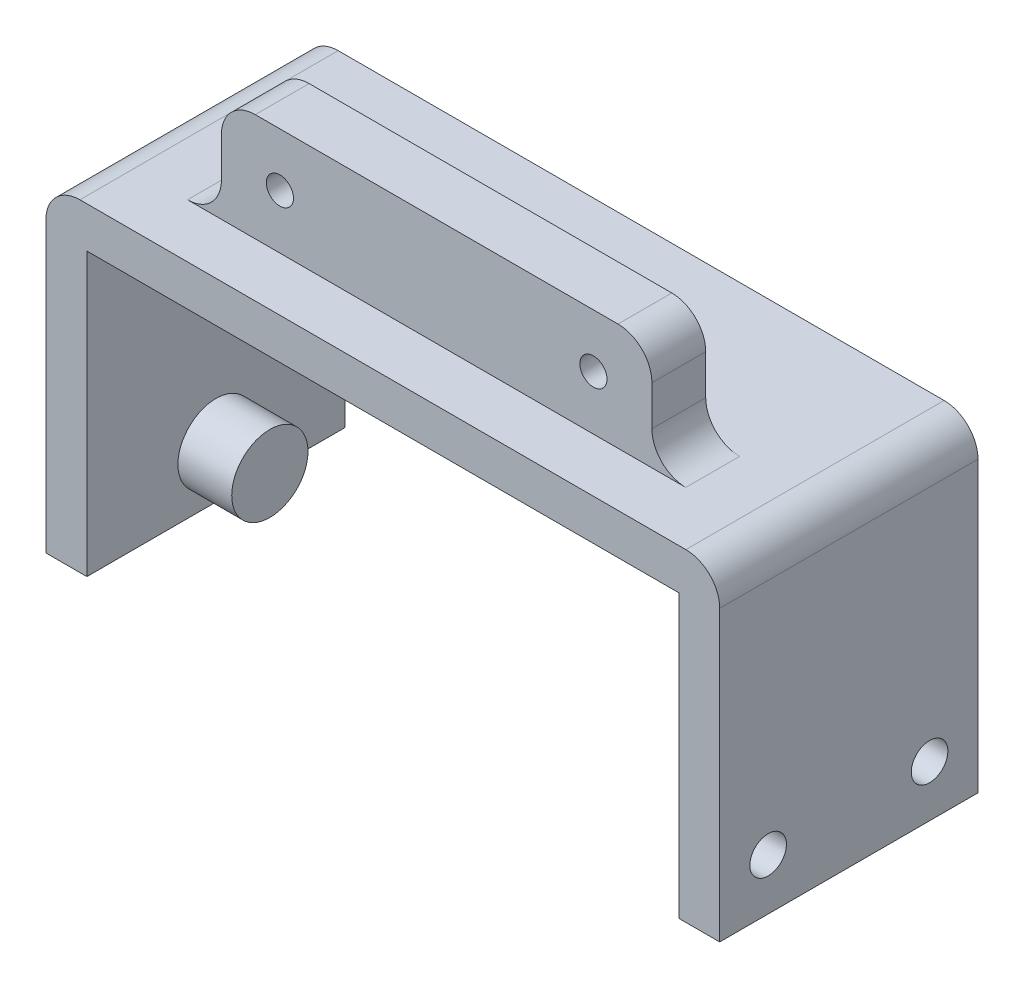
ISO-10303-21;
HEADER;
FILE_DESCRIPTION(('STEP AP214'),'2;1');
FILE_NAME('part.step','',(''),(''),'','','');
FILE_SCHEMA(('AUTOMOTIVE_DESIGN { 1 0 10303 214 1 1 1 1 }'));
ENDSEC;
DATA;
#1=APPLICATION_CONTEXT('core data for automotive mechanical design processes');
#2=APPLICATION_PROTOCOL_DEFINITION('international standard','automotive_design',2000,#1);
#3=PRODUCT_CONTEXT('',#1,'mechanical');
#4=PRODUCT('Part','Part','',(#3));
#5=PRODUCT_RELATED_PRODUCT_CATEGORY('part','',(#4));
#6=PRODUCT_DEFINITION_FORMATION('','',#4);
#7=PRODUCT_DEFINITION_CONTEXT('part definition',#1,'design');
#8=PRODUCT_DEFINITION('design','',#6,#7);
#9=PRODUCT_DEFINITION_SHAPE('','',#8);
#10=(LENGTH_UNIT() NAMED_UNIT(*) SI_UNIT(.MILLI.,.METRE.));
#11=(NAMED_UNIT(*) PLANE_ANGLE_UNIT() SI_UNIT($,.RADIAN.));
#12=(NAMED_UNIT(*) SI_UNIT($,.STERADIAN.) SOLID_ANGLE_UNIT());
#13=UNCERTAINTY_MEASURE_WITH_UNIT(LENGTH_MEASURE(1.E-05),#10,'distance_accuracy_value','');
#14=(GEOMETRIC_REPRESENTATION_CONTEXT(3) GLOBAL_UNCERTAINTY_ASSIGNED_CONTEXT((#13)) GLOBAL_UNIT_ASSIGNED_CONTEXT((#10,
#11,#12)) REPRESENTATION_CONTEXT('',''));
#15=CARTESIAN_POINT('',(0.,0.,0.));
#16=DIRECTION('',(0.,0.,1.));
#17=DIRECTION('',(1.,0.,0.));
#18=AXIS2_PLACEMENT_3D('',#15,#16,#17);
#19=CARTESIAN_POINT('',(4.826,38.1,0.));
#20=DIRECTION('',(0.,-1.,0.));
#21=DIRECTION('',(0.,0.,-1.));
#22=AXIS2_PLACEMENT_3D('',#19,#20,#21);
#23=PLANE('',#22);
#24=DIRECTION('',(-1.,0.,0.));
#25=VECTOR('',#24,1.);
#26=CARTESIAN_POINT('',(4.826,38.1,-30.48));
#27=LINE('',#26,#25);
#28=CARTESIAN_POINT('',(0.826,38.1,-30.48));
#29=VERTEX_POINT('',#28);
#30=CARTESIAN_POINT('',(-70.676,38.1,-30.48));
#31=VERTEX_POINT('',#30);
#32=EDGE_CURVE('E239',#29,#31,#27,.T.);
#33=ORIENTED_EDGE('',*,*,#32,.T.);
#34=DIRECTION('',(0.,0.,-1.));
#35=VECTOR('',#34,1.);
#36=CARTESIAN_POINT('',(-70.676,38.1,0.));
#37=LINE('',#36,#35);
#38=CARTESIAN_POINT('',(-70.676,38.1,0.));
#39=VERTEX_POINT('',#38);
#40=EDGE_CURVE('E269',#31,#39,#37,.F.);
#41=ORIENTED_EDGE('',*,*,#40,.T.);
#42=DIRECTION('',(-1.,0.,0.));
#43=VECTOR('',#42,1.);
#44=CARTESIAN_POINT('',(4.826,38.1,0.));
#45=LINE('',#44,#43);
#46=CARTESIAN_POINT('',(0.826,38.1,0.));
#47=VERTEX_POINT('',#46);
#48=EDGE_CURVE('E231',#47,#39,#45,.T.);
#49=ORIENTED_EDGE('',*,*,#48,.F.);
#50=DIRECTION('',(0.,0.,1.));
#51=VECTOR('',#50,1.);
#52=CARTESIAN_POINT('',(0.826,38.1,0.));
#53=LINE('',#52,#51);
#54=EDGE_CURVE('E267',#47,#29,#53,.F.);
#55=ORIENTED_EDGE('',*,*,#54,.T.);
#56=EDGE_LOOP('',(#33,#41,#49,#55));
#57=FACE_BOUND('',#56,.T.);
#58=DIRECTION('',(1.,0.,0.));
#59=VECTOR('',#58,1.);
#60=CARTESIAN_POINT('',(-60.325,38.1,-6.34999999999999));
#61=LINE('',#60,#59);
#62=CARTESIAN_POINT('',(-64.325,38.1,-6.34999999999999));
#63=VERTEX_POINT('',#62);
#64=CARTESIAN_POINT('',(-5.525,38.1,-6.34999999999999));
#65=VERTEX_POINT('',#64);
#66=EDGE_CURVE('E306',#63,#65,#61,.T.);
#67=ORIENTED_EDGE('',*,*,#66,.F.);
#68=DIRECTION('',(0.,0.,1.));
#69=VECTOR('',#68,1.);
#70=CARTESIAN_POINT('',(-64.325,38.1,-12.7));
#71=LINE('',#70,#69);
#72=CARTESIAN_POINT('',(-64.325,38.1,-12.7));
#73=VERTEX_POINT('',#72);
#74=EDGE_CURVE('E274',#63,#73,#71,.F.);
#75=ORIENTED_EDGE('',*,*,#74,.T.);
#76=DIRECTION('',(-1.,0.,0.));
#77=VECTOR('',#76,1.);
#78=CARTESIAN_POINT('',(-60.325,38.1,-12.7));
#79=LINE('',#78,#77);
#80=CARTESIAN_POINT('',(-5.525,38.1,-12.7));
#81=VERTEX_POINT('',#80);
#82=EDGE_CURVE('E320',#81,#73,#79,.T.);
#83=ORIENTED_EDGE('',*,*,#82,.F.);
#84=DIRECTION('',(0.,0.,-1.));
#85=VECTOR('',#84,1.);
#86=CARTESIAN_POINT('',(-5.525,38.1,-6.34999999999999));
#87=LINE('',#86,#85);
#88=EDGE_CURVE('E271',#81,#65,#87,.F.);
#89=ORIENTED_EDGE('',*,*,#88,.T.);
#90=EDGE_LOOP('',(#67,#75,#83,#89));
#91=FACE_BOUND('',#90,.T.);
#92=ADVANCED_FACE('F38',(#57,#91),#23,.F.);
#93=CARTESIAN_POINT('',(-74.676,33.274,-30.48));
#94=DIRECTION('',(0.,1.,0.));
#95=DIRECTION('',(0.,0.,1.));
#96=AXIS2_PLACEMENT_3D('',#93,#94,#95);
#97=PLANE('',#96);
#98=DIRECTION('',(0.,0.,1.));
#99=VECTOR('',#98,1.);
#100=CARTESIAN_POINT('',(-69.85,33.274,0.));
#101=LINE('',#100,#99);
#102=CARTESIAN_POINT('',(-69.85,33.274,-30.48));
#103=VERTEX_POINT('',#102);
#104=CARTESIAN_POINT('',(-69.85,33.274,0.));
#105=VERTEX_POINT('',#104);
#106=EDGE_CURVE('E191',#103,#105,#101,.T.);
#107=ORIENTED_EDGE('',*,*,#106,.F.);
#108=DIRECTION('',(1.,0.,0.));
#109=VECTOR('',#108,1.);
#110=CARTESIAN_POINT('',(-74.676,33.274,-30.48));
#111=LINE('',#110,#109);
#112=CARTESIAN_POINT('',(0.,33.274,-30.48));
#113=VERTEX_POINT('',#112);
#114=EDGE_CURVE('E209',#103,#113,#111,.T.);
#115=ORIENTED_EDGE('',*,*,#114,.T.);
#116=DIRECTION('',(0.,0.,1.));
#117=VECTOR('',#116,1.);
#118=CARTESIAN_POINT('',(0.,33.274,-30.48));
#119=LINE('',#118,#117);
#120=CARTESIAN_POINT('',(0.,33.274,0.));
#121=VERTEX_POINT('',#120);
#122=EDGE_CURVE('E176',#113,#121,#119,.T.);
#123=ORIENTED_EDGE('',*,*,#122,.T.);
#124=DIRECTION('',(1.,0.,0.));
#125=VECTOR('',#124,1.);
#126=CARTESIAN_POINT('',(-74.676,33.274,0.));
#127=LINE('',#126,#125);
#128=EDGE_CURVE('E205',#105,#121,#127,.T.);
#129=ORIENTED_EDGE('',*,*,#128,.F.);
#130=EDGE_LOOP('',(#107,#115,#123,#129));
#131=FACE_BOUND('',#130,.T.);
#132=ADVANCED_FACE('F370',(#131),#97,.F.);
#133=CARTESIAN_POINT('',(4.826,0.,0.));
#134=DIRECTION('',(-1.,0.,0.));
#135=DIRECTION('',(0.,0.,1.));
#136=AXIS2_PLACEMENT_3D('',#133,#134,#135);
#137=PLANE('',#136);
#138=DIRECTION('',(0.,1.,0.));
#139=VECTOR('',#138,1.);
#140=CARTESIAN_POINT('',(4.826,0.,-30.48));
#141=LINE('',#140,#139);
#142=CARTESIAN_POINT('',(4.826,0.,-30.48));
#143=VERTEX_POINT('',#142);
#144=CARTESIAN_POINT('',(4.826,34.1,-30.48));
#145=VERTEX_POINT('',#144);
#146=EDGE_CURVE('E229',#143,#145,#141,.T.);
#147=ORIENTED_EDGE('',*,*,#146,.T.);
#148=DIRECTION('',(0.,0.,1.));
#149=VECTOR('',#148,1.);
#150=CARTESIAN_POINT('',(4.826,34.1,0.));
#151=LINE('',#150,#149);
#152=CARTESIAN_POINT('',(4.826,34.1,0.));
#153=VERTEX_POINT('',#152);
#154=EDGE_CURVE('E289',#145,#153,#151,.T.);
#155=ORIENTED_EDGE('',*,*,#154,.T.);
#156=DIRECTION('',(0.,-1.,0.));
#157=VECTOR('',#156,1.);
#158=CARTESIAN_POINT('',(4.826,0.,0.));
#159=LINE('',#158,#157);
#160=CARTESIAN_POINT('',(4.826,0.,0.));
#161=VERTEX_POINT('',#160);
#162=EDGE_CURVE('E224',#153,#161,#159,.T.);
#163=ORIENTED_EDGE('',*,*,#162,.T.);
#164=DIRECTION('',(0.,0.,-1.));
#165=VECTOR('',#164,1.);
#166=CARTESIAN_POINT('',(4.826,0.,0.));
#167=LINE('',#166,#165);
#168=EDGE_CURVE('E226',#161,#143,#167,.T.);
#169=ORIENTED_EDGE('',*,*,#168,.T.);
#170=EDGE_LOOP('',(#147,#155,#163,#169));
#171=FACE_BOUND('',#170,.T.);
#172=CARTESIAN_POINT('',(4.826,6.05,-5.71499999999998));
#173=DIRECTION('',(1.,0.,0.));
#174=DIRECTION('',(0.,0.,-1.));
#175=AXIS2_PLACEMENT_3D('',#172,#173,#174);
#176=CIRCLE('',#175,2.159);
#177=CARTESIAN_POINT('',(4.826,6.05,-7.87399999999998));
#178=VERTEX_POINT('',#177);
#179=EDGE_CURVE('E218',#178,#178,#176,.T.);
#180=ORIENTED_EDGE('',*,*,#179,.F.);
#181=EDGE_LOOP('',(#180));
#182=FACE_BOUND('',#181,.T.);
#183=CARTESIAN_POINT('',(4.826,6.05,-24.765));
#184=DIRECTION('',(1.,0.,0.));
#185=DIRECTION('',(0.,0.,1.));
#186=AXIS2_PLACEMENT_3D('',#183,#184,#185);
#187=CIRCLE('',#186,2.159);
#188=CARTESIAN_POINT('',(4.826,6.05,-22.606));
#189=VERTEX_POINT('',#188);
#190=EDGE_CURVE('E212',#189,#189,#187,.T.);
#191=ORIENTED_EDGE('',*,*,#190,.F.);
#192=EDGE_LOOP('',(#191));
#193=FACE_BOUND('',#192,.T.);
#194=ADVANCED_FACE('F385',(#171,#182,#193),#137,.F.);
#195=CARTESIAN_POINT('',(0.,0.,0.));
#196=DIRECTION('',(-1.,0.,0.));
#197=DIRECTION('',(0.,0.,1.));
#198=AXIS2_PLACEMENT_3D('',#195,#196,#197);
#199=PLANE('',#198);
#200=ORIENTED_EDGE('',*,*,#122,.F.);
#201=DIRECTION('',(0.,1.,0.));
#202=VECTOR('',#201,1.);
#203=CARTESIAN_POINT('',(0.,0.,-30.48));
#204=LINE('',#203,#202);
#205=CARTESIAN_POINT('',(0.,0.,-30.48));
#206=VERTEX_POINT('',#205);
#207=EDGE_CURVE('E227',#206,#113,#204,.T.);
#208=ORIENTED_EDGE('',*,*,#207,.F.);
#209=DIRECTION('',(0.,0.,-1.));
#210=VECTOR('',#209,1.);
#211=CARTESIAN_POINT('',(0.,0.,0.));
#212=LINE('',#211,#210);
#213=CARTESIAN_POINT('',(0.,0.,0.));
#214=VERTEX_POINT('',#213);
#215=EDGE_CURVE('E233',#214,#206,#212,.T.);
#216=ORIENTED_EDGE('',*,*,#215,.F.);
#217=DIRECTION('',(0.,-1.,0.));
#218=VECTOR('',#217,1.);
#219=CARTESIAN_POINT('',(0.,0.,0.));
#220=LINE('',#219,#218);
#221=EDGE_CURVE('E221',#121,#214,#220,.T.);
#222=ORIENTED_EDGE('',*,*,#221,.F.);
#223=EDGE_LOOP('',(#200,#208,#216,#222));
#224=FACE_BOUND('',#223,.T.);
#225=CARTESIAN_POINT('',(0.,6.05,-5.71499999999998));
#226=DIRECTION('',(1.,0.,0.));
#227=DIRECTION('',(0.,0.,-1.));
#228=AXIS2_PLACEMENT_3D('',#225,#226,#227);
#229=CIRCLE('',#228,2.159);
#230=CARTESIAN_POINT('',(0.,6.05,-7.87399999999998));
#231=VERTEX_POINT('',#230);
#232=EDGE_CURVE('E215',#231,#231,#229,.T.);
#233=ORIENTED_EDGE('',*,*,#232,.T.);
#234=EDGE_LOOP('',(#233));
#235=FACE_BOUND('',#234,.T.);
#236=CARTESIAN_POINT('',(0.,6.05,-24.765));
#237=DIRECTION('',(1.,0.,0.));
#238=DIRECTION('',(0.,0.,1.));
#239=AXIS2_PLACEMENT_3D('',#236,#237,#238);
#240=CIRCLE('',#239,2.159);
#241=CARTESIAN_POINT('',(0.,6.05,-22.606));
#242=VERTEX_POINT('',#241);
#243=EDGE_CURVE('E211',#242,#242,#240,.T.);
#244=ORIENTED_EDGE('',*,*,#243,.T.);
#245=EDGE_LOOP('',(#244));
#246=FACE_BOUND('',#245,.T.);
#247=ADVANCED_FACE('F374',(#224,#235,#246),#199,.T.);
#248=CARTESIAN_POINT('',(4.826,0.,0.));
#249=DIRECTION('',(0.,0.,-1.));
#250=DIRECTION('',(0.,1.,0.));
#251=AXIS2_PLACEMENT_3D('',#248,#249,#250);
#252=PLANE('',#251);
#253=ORIENTED_EDGE('',*,*,#48,.T.);
#254=CARTESIAN_POINT('',(-70.676,34.1,0.));
#255=DIRECTION('',(0.,0.,-1.));
#256=DIRECTION('',(0.,1.,0.));
#257=AXIS2_PLACEMENT_3D('',#254,#255,#256);
#258=CIRCLE('',#257,4.);
#259=CARTESIAN_POINT('',(-74.676,34.1,0.));
#260=VERTEX_POINT('',#259);
#261=EDGE_CURVE('E287',#39,#260,#258,.F.);
#262=ORIENTED_EDGE('',*,*,#261,.T.);
#263=DIRECTION('',(0.,1.,0.));
#264=VECTOR('',#263,1.);
#265=CARTESIAN_POINT('',(-74.676,38.1,0.));
#266=LINE('',#265,#264);
#267=CARTESIAN_POINT('',(-74.676,0.,0.));
#268=VERTEX_POINT('',#267);
#269=EDGE_CURVE('E175',#268,#260,#266,.T.);
#270=ORIENTED_EDGE('',*,*,#269,.F.);
#271=DIRECTION('',(-1.,0.,0.));
#272=VECTOR('',#271,1.);
#273=CARTESIAN_POINT('',(-74.676,0.,0.));
#274=LINE('',#273,#272);
#275=CARTESIAN_POINT('',(-69.85,0.,0.));
#276=VERTEX_POINT('',#275);
#277=EDGE_CURVE('E190',#276,#268,#274,.T.);
#278=ORIENTED_EDGE('',*,*,#277,.F.);
#279=DIRECTION('',(0.,1.,0.));
#280=VECTOR('',#279,1.);
#281=CARTESIAN_POINT('',(-69.85,0.,0.));
#282=LINE('',#281,#280);
#283=EDGE_CURVE('E199',#276,#105,#282,.T.);
#284=ORIENTED_EDGE('',*,*,#283,.T.);
#285=ORIENTED_EDGE('',*,*,#128,.T.);
#286=ORIENTED_EDGE('',*,*,#221,.T.);
#287=DIRECTION('',(-1.,0.,0.));
#288=VECTOR('',#287,1.);
#289=CARTESIAN_POINT('',(4.826,0.,0.));
#290=LINE('',#289,#288);
#291=EDGE_CURVE('E245',#161,#214,#290,.T.);
#292=ORIENTED_EDGE('',*,*,#291,.F.);
#293=ORIENTED_EDGE('',*,*,#162,.F.);
#294=CARTESIAN_POINT('',(0.826,34.1,0.));
#295=DIRECTION('',(0.,0.,-1.));
#296=DIRECTION('',(0.,1.,0.));
#297=AXIS2_PLACEMENT_3D('',#294,#295,#296);
#298=CIRCLE('',#297,4.);
#299=EDGE_CURVE('E53',#153,#47,#298,.F.);
#300=ORIENTED_EDGE('',*,*,#299,.T.);
#301=EDGE_LOOP('',(#253,#262,#270,#278,#284,#285,#286,#292,#293,#300));
#302=FACE_BOUND('',#301,.T.);
#303=ADVANCED_FACE('F368',(#302),#252,.F.);
#304=CARTESIAN_POINT('',(4.826,0.,0.));
#305=DIRECTION('',(0.,1.,0.));
#306=DIRECTION('',(0.,0.,1.));
#307=AXIS2_PLACEMENT_3D('',#304,#305,#306);
#308=PLANE('',#307);
#309=ORIENTED_EDGE('',*,*,#215,.T.);
#310=DIRECTION('',(-1.,0.,0.));
#311=VECTOR('',#310,1.);
#312=CARTESIAN_POINT('',(4.826,0.,-30.48));
#313=LINE('',#312,#311);
#314=EDGE_CURVE('E242',#143,#206,#313,.T.);
#315=ORIENTED_EDGE('',*,*,#314,.F.);
#316=ORIENTED_EDGE('',*,*,#168,.F.);
#317=ORIENTED_EDGE('',*,*,#291,.T.);
#318=EDGE_LOOP('',(#309,#315,#316,#317));
#319=FACE_BOUND('',#318,.T.);
#320=ADVANCED_FACE('F380',(#319),#308,.F.);
#321=CARTESIAN_POINT('',(4.826,0.,-30.48));
#322=DIRECTION('',(0.,0.,1.));
#323=DIRECTION('',(0.,-1.,0.));
#324=AXIS2_PLACEMENT_3D('',#321,#322,#323);
#325=PLANE('',#324);
#326=DIRECTION('',(0.,-1.,0.));
#327=VECTOR('',#326,1.);
#328=CARTESIAN_POINT('',(-74.676,38.1,-30.48));
#329=LINE('',#328,#327);
#330=CARTESIAN_POINT('',(-74.676,34.1,-30.48));
#331=VERTEX_POINT('',#330);
#332=CARTESIAN_POINT('',(-74.676,0.,-30.48));
#333=VERTEX_POINT('',#332);
#334=EDGE_CURVE('E167',#331,#333,#329,.T.);
#335=ORIENTED_EDGE('',*,*,#334,.F.);
#336=CARTESIAN_POINT('',(-70.676,34.1,-30.48));
#337=DIRECTION('',(0.,0.,1.));
#338=DIRECTION('',(0.,-1.,0.));
#339=AXIS2_PLACEMENT_3D('',#336,#337,#338);
#340=CIRCLE('',#339,4.);
#341=EDGE_CURVE('E284',#331,#31,#340,.F.);
#342=ORIENTED_EDGE('',*,*,#341,.T.);
#343=ORIENTED_EDGE('',*,*,#32,.F.);
#344=CARTESIAN_POINT('',(0.826,34.1,-30.48));
#345=DIRECTION('',(0.,0.,1.));
#346=DIRECTION('',(0.,-1.,0.));
#347=AXIS2_PLACEMENT_3D('',#344,#345,#346);
#348=CIRCLE('',#347,4.);
#349=EDGE_CURVE('E61',#29,#145,#348,.F.);
#350=ORIENTED_EDGE('',*,*,#349,.T.);
#351=ORIENTED_EDGE('',*,*,#146,.F.);
#352=ORIENTED_EDGE('',*,*,#314,.T.);
#353=ORIENTED_EDGE('',*,*,#207,.T.);
#354=ORIENTED_EDGE('',*,*,#114,.F.);
#355=DIRECTION('',(0.,1.,0.));
#356=VECTOR('',#355,1.);
#357=CARTESIAN_POINT('',(-69.85,0.,-30.48));
#358=LINE('',#357,#356);
#359=CARTESIAN_POINT('',(-69.85,0.,-30.48));
#360=VERTEX_POINT('',#359);
#361=EDGE_CURVE('E182',#360,#103,#358,.T.);
#362=ORIENTED_EDGE('',*,*,#361,.F.);
#363=DIRECTION('',(1.,0.,0.));
#364=VECTOR('',#363,1.);
#365=CARTESIAN_POINT('',(-74.676,0.,-30.48));
#366=LINE('',#365,#364);
#367=EDGE_CURVE('E179',#333,#360,#366,.T.);
#368=ORIENTED_EDGE('',*,*,#367,.F.);
#369=EDGE_LOOP('',(#335,#342,#343,#350,#351,#352,#353,#354,#362,#368));
#370=FACE_BOUND('',#369,.T.);
#371=ADVANCED_FACE('F180',(#370),#325,.F.);
#372=CARTESIAN_POINT('',(4.826,6.05,-5.71499999999998));
#373=DIRECTION('',(-1.,0.,0.));
#374=DIRECTION('',(0.,0.,1.));
#375=AXIS2_PLACEMENT_3D('',#372,#373,#374);
#376=CYLINDRICAL_SURFACE('',#375,2.159);
#377=ORIENTED_EDGE('',*,*,#179,.T.);
#378=EDGE_LOOP('',(#377));
#379=FACE_BOUND('',#378,.T.);
#380=ORIENTED_EDGE('',*,*,#232,.F.);
#381=EDGE_LOOP('',(#380));
#382=FACE_BOUND('',#381,.T.);
#383=ADVANCED_FACE('F412',(#379,#382),#376,.F.);
#384=CARTESIAN_POINT('',(4.826,6.05,-24.765));
#385=DIRECTION('',(-1.,0.,0.));
#386=DIRECTION('',(0.,0.,1.));
#387=AXIS2_PLACEMENT_3D('',#384,#385,#386);
#388=CYLINDRICAL_SURFACE('',#387,2.159);
#389=ORIENTED_EDGE('',*,*,#190,.T.);
#390=EDGE_LOOP('',(#389));
#391=FACE_BOUND('',#390,.T.);
#392=ORIENTED_EDGE('',*,*,#243,.F.);
#393=EDGE_LOOP('',(#392));
#394=FACE_BOUND('',#393,.T.);
#395=ADVANCED_FACE('F498',(#391,#394),#388,.F.);
#396=CARTESIAN_POINT('',(-74.676,0.,0.));
#397=DIRECTION('',(-1.,0.,0.));
#398=DIRECTION('',(0.,0.,1.));
#399=AXIS2_PLACEMENT_3D('',#396,#397,#398);
#400=PLANE('',#399);
#401=ORIENTED_EDGE('',*,*,#269,.T.);
#402=DIRECTION('',(0.,0.,-1.));
#403=VECTOR('',#402,1.);
#404=CARTESIAN_POINT('',(-74.676,34.1,-30.48));
#405=LINE('',#404,#403);
#406=EDGE_CURVE('E174',#260,#331,#405,.T.);
#407=ORIENTED_EDGE('',*,*,#406,.T.);
#408=ORIENTED_EDGE('',*,*,#334,.T.);
#409=DIRECTION('',(0.,0.,-1.));
#410=VECTOR('',#409,1.);
#411=CARTESIAN_POINT('',(-74.676,0.,0.));
#412=LINE('',#411,#410);
#413=EDGE_CURVE('E172',#268,#333,#412,.T.);
#414=ORIENTED_EDGE('',*,*,#413,.F.);
#415=EDGE_LOOP('',(#401,#407,#408,#414));
#416=FACE_BOUND('',#415,.T.);
#417=ADVANCED_FACE('F170',(#416),#400,.T.);
#418=CARTESIAN_POINT('',(-69.85,0.,0.));
#419=DIRECTION('',(-1.,0.,0.));
#420=DIRECTION('',(0.,0.,1.));
#421=AXIS2_PLACEMENT_3D('',#418,#419,#420);
#422=PLANE('',#421);
#423=CARTESIAN_POINT('',(-69.85,6.096,-15.24));
#424=DIRECTION('',(-1.,0.,0.));
#425=DIRECTION('',(0.,0.,1.));
#426=AXIS2_PLACEMENT_3D('',#423,#424,#425);
#427=CIRCLE('',#426,4.5);
#428=CARTESIAN_POINT('',(-69.85,6.096,-10.74));
#429=VERTEX_POINT('',#428);
#430=EDGE_CURVE('E11',#429,#429,#427,.F.);
#431=ORIENTED_EDGE('',*,*,#430,.F.);
#432=EDGE_LOOP('',(#431));
#433=FACE_BOUND('',#432,.T.);
#434=ORIENTED_EDGE('',*,*,#106,.T.);
#435=ORIENTED_EDGE('',*,*,#283,.F.);
#436=DIRECTION('',(0.,0.,1.));
#437=VECTOR('',#436,1.);
#438=CARTESIAN_POINT('',(-69.85,0.,0.));
#439=LINE('',#438,#437);
#440=EDGE_CURVE('E185',#360,#276,#439,.T.);
#441=ORIENTED_EDGE('',*,*,#440,.F.);
#442=ORIENTED_EDGE('',*,*,#361,.T.);
#443=EDGE_LOOP('',(#434,#435,#441,#442));
#444=FACE_BOUND('',#443,.T.);
#445=ADVANCED_FACE('F359',(#433,#444),#422,.F.);
#446=CARTESIAN_POINT('',(0.,0.,0.));
#447=DIRECTION('',(0.,-1.,0.));
#448=DIRECTION('',(0.,0.,-1.));
#449=AXIS2_PLACEMENT_3D('',#446,#447,#448);
#450=PLANE('',#449);
#451=ORIENTED_EDGE('',*,*,#413,.T.);
#452=ORIENTED_EDGE('',*,*,#367,.T.);
#453=ORIENTED_EDGE('',*,*,#440,.T.);
#454=ORIENTED_EDGE('',*,*,#277,.T.);
#455=EDGE_LOOP('',(#451,#452,#453,#454));
#456=FACE_BOUND('',#455,.T.);
#457=ADVANCED_FACE('F188',(#456),#450,.T.);
#458=CARTESIAN_POINT('',(-60.325,50.8,-6.34999999999999));
#459=DIRECTION('',(1.,0.,0.));
#460=DIRECTION('',(0.,0.,-1.));
#461=AXIS2_PLACEMENT_3D('',#458,#459,#460);
#462=PLANE('',#461);
#463=DIRECTION('',(0.,-1.,0.));
#464=VECTOR('',#463,1.);
#465=CARTESIAN_POINT('',(-60.325,50.8,-6.34999999999999));
#466=LINE('',#465,#464);
#467=CARTESIAN_POINT('',(-60.325,46.8,-6.34999999999999));
#468=VERTEX_POINT('',#467);
#469=CARTESIAN_POINT('',(-60.325,42.1,-6.34999999999999));
#470=VERTEX_POINT('',#469);
#471=EDGE_CURVE('E193',#468,#470,#466,.T.);
#472=ORIENTED_EDGE('',*,*,#471,.F.);
#473=DIRECTION('',(0.,0.,1.));
#474=VECTOR('',#473,1.);
#475=CARTESIAN_POINT('',(-60.325,46.8,-6.34999999999999));
#476=LINE('',#475,#474);
#477=CARTESIAN_POINT('',(-60.325,46.8,-12.7));
#478=VERTEX_POINT('',#477);
#479=EDGE_CURVE('E261',#468,#478,#476,.F.);
#480=ORIENTED_EDGE('',*,*,#479,.T.);
#481=DIRECTION('',(0.,-1.,0.));
#482=VECTOR('',#481,1.);
#483=CARTESIAN_POINT('',(-60.325,50.8,-12.7));
#484=LINE('',#483,#482);
#485=CARTESIAN_POINT('',(-60.325,42.1,-12.7));
#486=VERTEX_POINT('',#485);
#487=EDGE_CURVE('E322',#478,#486,#484,.T.);
#488=ORIENTED_EDGE('',*,*,#487,.T.);
#489=DIRECTION('',(0.,0.,1.));
#490=VECTOR('',#489,1.);
#491=CARTESIAN_POINT('',(-60.325,42.1,-6.34999999999999));
#492=LINE('',#491,#490);
#493=EDGE_CURVE('E258',#486,#470,#492,.T.);
#494=ORIENTED_EDGE('',*,*,#493,.T.);
#495=EDGE_LOOP('',(#472,#480,#488,#494));
#496=FACE_BOUND('',#495,.T.);
#497=ADVANCED_FACE('F492',(#496),#462,.F.);
#498=CARTESIAN_POINT('',(-60.325,50.8,-6.34999999999999));
#499=DIRECTION('',(0.,0.,-1.));
#500=DIRECTION('',(-1.,0.,0.));
#501=AXIS2_PLACEMENT_3D('',#498,#499,#500);
#502=PLANE('',#501);
#503=CARTESIAN_POINT('',(-16.4249999999999,44.4999999999998,-6.34999999999999));
#504=DIRECTION('',(0.,0.,-1.));
#505=DIRECTION('',(-1.,0.,0.));
#506=AXIS2_PLACEMENT_3D('',#503,#504,#505);
#507=CIRCLE('',#506,1.6);
#508=CARTESIAN_POINT('',(-18.0249999999999,44.4999999999998,-6.34999999999999));
#509=VERTEX_POINT('',#508);
#510=EDGE_CURVE('E331',#509,#509,#507,.F.);
#511=ORIENTED_EDGE('',*,*,#510,.F.);
#512=EDGE_LOOP('',(#511));
#513=FACE_BOUND('',#512,.T.);
#514=CARTESIAN_POINT('',(-53.4249999999999,44.4999999999998,-6.34999999999999));
#515=DIRECTION('',(0.,0.,-1.));
#516=DIRECTION('',(-1.,0.,0.));
#517=AXIS2_PLACEMENT_3D('',#514,#515,#516);
#518=CIRCLE('',#517,1.6);
#519=CARTESIAN_POINT('',(-55.0249999999999,44.4999999999998,-6.34999999999999));
#520=VERTEX_POINT('',#519);
#521=EDGE_CURVE('E336',#520,#520,#518,.F.);
#522=ORIENTED_EDGE('',*,*,#521,.F.);
#523=EDGE_LOOP('',(#522));
#524=FACE_BOUND('',#523,.T.);
#525=DIRECTION('',(1.,0.,0.));
#526=VECTOR('',#525,1.);
#527=CARTESIAN_POINT('',(-60.325,50.8,-6.34999999999999));
#528=LINE('',#527,#526);
#529=CARTESIAN_POINT('',(-56.325,50.8,-6.34999999999999));
#530=VERTEX_POINT('',#529);
#531=CARTESIAN_POINT('',(-13.525,50.8,-6.34999999999999));
#532=VERTEX_POINT('',#531);
#533=EDGE_CURVE('E329',#530,#532,#528,.T.);
#534=ORIENTED_EDGE('',*,*,#533,.F.);
#535=CARTESIAN_POINT('',(-56.325,46.8,-6.34999999999999));
#536=DIRECTION('',(0.,0.,-1.));
#537=DIRECTION('',(-1.,0.,0.));
#538=AXIS2_PLACEMENT_3D('',#535,#536,#537);
#539=CIRCLE('',#538,4.);
#540=EDGE_CURVE('E256',#530,#468,#539,.F.);
#541=ORIENTED_EDGE('',*,*,#540,.T.);
#542=ORIENTED_EDGE('',*,*,#471,.T.);
#543=CARTESIAN_POINT('',(-64.325,42.1,-6.34999999999999));
#544=DIRECTION('',(0.,0.,-1.));
#545=DIRECTION('',(-1.,0.,0.));
#546=AXIS2_PLACEMENT_3D('',#543,#544,#545);
#547=CIRCLE('',#546,4.);
#548=EDGE_CURVE('E291',#470,#63,#547,.T.);
#549=ORIENTED_EDGE('',*,*,#548,.T.);
#550=ORIENTED_EDGE('',*,*,#66,.T.);
#551=CARTESIAN_POINT('',(-5.525,42.1,-6.34999999999999));
#552=DIRECTION('',(0.,0.,-1.));
#553=DIRECTION('',(-1.,0.,0.));
#554=AXIS2_PLACEMENT_3D('',#551,#552,#553);
#555=CIRCLE('',#554,4.);
#556=CARTESIAN_POINT('',(-9.525,42.1,-6.34999999999999));
#557=VERTEX_POINT('',#556);
#558=EDGE_CURVE('E46',#65,#557,#555,.T.);
#559=ORIENTED_EDGE('',*,*,#558,.T.);
#560=DIRECTION('',(0.,-1.,0.));
#561=VECTOR('',#560,1.);
#562=CARTESIAN_POINT('',(-9.525,50.8,-6.34999999999999));
#563=LINE('',#562,#561);
#564=CARTESIAN_POINT('',(-9.525,46.8,-6.34999999999999));
#565=VERTEX_POINT('',#564);
#566=EDGE_CURVE('E304',#565,#557,#563,.T.);
#567=ORIENTED_EDGE('',*,*,#566,.F.);
#568=CARTESIAN_POINT('',(-13.525,46.8,-6.34999999999999));
#569=DIRECTION('',(0.,0.,-1.));
#570=DIRECTION('',(-1.,0.,0.));
#571=AXIS2_PLACEMENT_3D('',#568,#569,#570);
#572=CIRCLE('',#571,4.);
#573=EDGE_CURVE('E254',#565,#532,#572,.F.);
#574=ORIENTED_EDGE('',*,*,#573,.T.);
#575=EDGE_LOOP('',(#534,#541,#542,#549,#550,#559,#567,#574));
#576=FACE_BOUND('',#575,.T.);
#577=ADVANCED_FACE('F303',(#513,#524,#576),#502,.F.);
#578=CARTESIAN_POINT('',(-9.525,50.8,-6.34999999999999));
#579=DIRECTION('',(-1.,0.,0.));
#580=DIRECTION('',(0.,0.,1.));
#581=AXIS2_PLACEMENT_3D('',#578,#579,#580);
#582=PLANE('',#581);
#583=ORIENTED_EDGE('',*,*,#566,.T.);
#584=DIRECTION('',(0.,0.,-1.));
#585=VECTOR('',#584,1.);
#586=CARTESIAN_POINT('',(-9.525,42.1,-12.7));
#587=LINE('',#586,#585);
#588=CARTESIAN_POINT('',(-9.525,42.1,-12.7));
#589=VERTEX_POINT('',#588);
#590=EDGE_CURVE('E279',#557,#589,#587,.T.);
#591=ORIENTED_EDGE('',*,*,#590,.T.);
#592=DIRECTION('',(0.,-1.,0.));
#593=VECTOR('',#592,1.);
#594=CARTESIAN_POINT('',(-9.525,50.8,-12.7));
#595=LINE('',#594,#593);
#596=CARTESIAN_POINT('',(-9.525,46.8,-12.7));
#597=VERTEX_POINT('',#596);
#598=EDGE_CURVE('E315',#597,#589,#595,.T.);
#599=ORIENTED_EDGE('',*,*,#598,.F.);
#600=DIRECTION('',(0.,0.,-1.));
#601=VECTOR('',#600,1.);
#602=CARTESIAN_POINT('',(-9.525,46.8,-6.34999999999999));
#603=LINE('',#602,#601);
#604=EDGE_CURVE('E277',#597,#565,#603,.F.);
#605=ORIENTED_EDGE('',*,*,#604,.T.);
#606=EDGE_LOOP('',(#583,#591,#599,#605));
#607=FACE_BOUND('',#606,.T.);
#608=ADVANCED_FACE('F311',(#607),#582,.F.);
#609=CARTESIAN_POINT('',(-60.325,50.8,-12.7));
#610=DIRECTION('',(0.,0.,1.));
#611=DIRECTION('',(1.,0.,0.));
#612=AXIS2_PLACEMENT_3D('',#609,#610,#611);
#613=PLANE('',#612);
#614=CARTESIAN_POINT('',(-16.4249999999999,44.4999999999998,-12.7));
#615=DIRECTION('',(0.,0.,-1.));
#616=DIRECTION('',(-1.,0.,0.));
#617=AXIS2_PLACEMENT_3D('',#614,#615,#616);
#618=CIRCLE('',#617,1.6);
#619=CARTESIAN_POINT('',(-18.0249999999999,44.4999999999998,-12.7));
#620=VERTEX_POINT('',#619);
#621=EDGE_CURVE('E339',#620,#620,#618,.T.);
#622=ORIENTED_EDGE('',*,*,#621,.F.);
#623=EDGE_LOOP('',(#622));
#624=FACE_BOUND('',#623,.T.);
#625=CARTESIAN_POINT('',(-53.4249999999999,44.4999999999998,-12.7));
#626=DIRECTION('',(0.,0.,-1.));
#627=DIRECTION('',(-1.,0.,0.));
#628=AXIS2_PLACEMENT_3D('',#625,#626,#627);
#629=CIRCLE('',#628,1.6);
#630=CARTESIAN_POINT('',(-55.0249999999999,44.4999999999998,-12.7));
#631=VERTEX_POINT('',#630);
#632=EDGE_CURVE('E340',#631,#631,#629,.T.);
#633=ORIENTED_EDGE('',*,*,#632,.F.);
#634=EDGE_LOOP('',(#633));
#635=FACE_BOUND('',#634,.T.);
#636=ORIENTED_EDGE('',*,*,#487,.F.);
#637=CARTESIAN_POINT('',(-56.325,46.8,-12.7));
#638=DIRECTION('',(0.,0.,1.));
#639=DIRECTION('',(1.,0.,0.));
#640=AXIS2_PLACEMENT_3D('',#637,#638,#639);
#641=CIRCLE('',#640,4.);
#642=CARTESIAN_POINT('',(-56.325,50.8,-12.7));
#643=VERTEX_POINT('',#642);
#644=EDGE_CURVE('E265',#478,#643,#641,.F.);
#645=ORIENTED_EDGE('',*,*,#644,.T.);
#646=DIRECTION('',(-1.,0.,0.));
#647=VECTOR('',#646,1.);
#648=CARTESIAN_POINT('',(-60.325,50.8,-12.7));
#649=LINE('',#648,#647);
#650=CARTESIAN_POINT('',(-13.525,50.8,-12.7));
#651=VERTEX_POINT('',#650);
#652=EDGE_CURVE('E325',#651,#643,#649,.T.);
#653=ORIENTED_EDGE('',*,*,#652,.F.);
#654=CARTESIAN_POINT('',(-13.525,46.8,-12.7));
#655=DIRECTION('',(0.,0.,1.));
#656=DIRECTION('',(1.,0.,0.));
#657=AXIS2_PLACEMENT_3D('',#654,#655,#656);
#658=CIRCLE('',#657,4.);
#659=EDGE_CURVE('E263',#651,#597,#658,.F.);
#660=ORIENTED_EDGE('',*,*,#659,.T.);
#661=ORIENTED_EDGE('',*,*,#598,.T.);
#662=CARTESIAN_POINT('',(-5.525,42.1,-12.7));
#663=DIRECTION('',(0.,0.,1.));
#664=DIRECTION('',(1.,0.,0.));
#665=AXIS2_PLACEMENT_3D('',#662,#663,#664);
#666=CIRCLE('',#665,4.);
#667=EDGE_CURVE('E296',#589,#81,#666,.T.);
#668=ORIENTED_EDGE('',*,*,#667,.T.);
#669=ORIENTED_EDGE('',*,*,#82,.T.);
#670=CARTESIAN_POINT('',(-64.325,42.1,-12.7));
#671=DIRECTION('',(0.,0.,1.));
#672=DIRECTION('',(1.,0.,0.));
#673=AXIS2_PLACEMENT_3D('',#670,#671,#672);
#674=CIRCLE('',#673,4.);
#675=EDGE_CURVE('E294',#73,#486,#674,.T.);
#676=ORIENTED_EDGE('',*,*,#675,.T.);
#677=EDGE_LOOP('',(#636,#645,#653,#660,#661,#668,#669,#676));
#678=FACE_BOUND('',#677,.T.);
#679=ADVANCED_FACE('F319',(#624,#635,#678),#613,.F.);
#680=CARTESIAN_POINT('',(0.,50.8,0.));
#681=DIRECTION('',(0.,-1.,0.));
#682=DIRECTION('',(0.,0.,-1.));
#683=AXIS2_PLACEMENT_3D('',#680,#681,#682);
#684=PLANE('',#683);
#685=ORIENTED_EDGE('',*,*,#652,.T.);
#686=DIRECTION('',(0.,0.,1.));
#687=VECTOR('',#686,1.);
#688=CARTESIAN_POINT('',(-56.325,50.8,0.));
#689=LINE('',#688,#687);
#690=EDGE_CURVE('E251',#643,#530,#689,.T.);
#691=ORIENTED_EDGE('',*,*,#690,.T.);
#692=ORIENTED_EDGE('',*,*,#533,.T.);
#693=DIRECTION('',(0.,0.,-1.));
#694=VECTOR('',#693,1.);
#695=CARTESIAN_POINT('',(-13.525,50.8,0.));
#696=LINE('',#695,#694);
#697=EDGE_CURVE('E248',#532,#651,#696,.T.);
#698=ORIENTED_EDGE('',*,*,#697,.T.);
#699=EDGE_LOOP('',(#685,#691,#692,#698));
#700=FACE_BOUND('',#699,.T.);
#701=ADVANCED_FACE('F480',(#700),#684,.F.);
#702=CARTESIAN_POINT('',(-53.4249999999999,44.4999999999998,0.00100000000002702));
#703=DIRECTION('',(0.,0.,-1.));
#704=DIRECTION('',(-1.,0.,0.));
#705=AXIS2_PLACEMENT_3D('',#702,#703,#704);
#706=CYLINDRICAL_SURFACE('',#705,1.6);
#707=ORIENTED_EDGE('',*,*,#632,.T.);
#708=EDGE_LOOP('',(#707));
#709=FACE_BOUND('',#708,.T.);
#710=ORIENTED_EDGE('',*,*,#521,.T.);
#711=EDGE_LOOP('',(#710));
#712=FACE_BOUND('',#711,.T.);
#713=ADVANCED_FACE('F476',(#709,#712),#706,.F.);
#714=CARTESIAN_POINT('',(-16.4249999999999,44.4999999999998,0.00100000000001835));
#715=DIRECTION('',(0.,0.,-1.));
#716=DIRECTION('',(-1.,0.,0.));
#717=AXIS2_PLACEMENT_3D('',#714,#715,#716);
#718=CYLINDRICAL_SURFACE('',#717,1.6);
#719=ORIENTED_EDGE('',*,*,#621,.T.);
#720=EDGE_LOOP('',(#719));
#721=FACE_BOUND('',#720,.T.);
#722=ORIENTED_EDGE('',*,*,#510,.T.);
#723=EDGE_LOOP('',(#722));
#724=FACE_BOUND('',#723,.T.);
#725=ADVANCED_FACE('F421',(#721,#724),#718,.F.);
#726=CARTESIAN_POINT('',(-56.325,46.8,0.));
#727=DIRECTION('',(0.,0.,1.));
#728=DIRECTION('',(1.,0.,0.));
#729=AXIS2_PLACEMENT_3D('',#726,#727,#728);
#730=CYLINDRICAL_SURFACE('',#729,4.);
#731=ORIENTED_EDGE('',*,*,#644,.F.);
#732=ORIENTED_EDGE('',*,*,#479,.F.);
#733=ORIENTED_EDGE('',*,*,#540,.F.);
#734=ORIENTED_EDGE('',*,*,#690,.F.);
#735=EDGE_LOOP('',(#731,#732,#733,#734));
#736=FACE_BOUND('',#735,.T.);
#737=ADVANCED_FACE('F417',(#736),#730,.T.);
#738=CARTESIAN_POINT('',(-64.325,42.1,-6.34999999999999));
#739=DIRECTION('',(0.,0.,-1.));
#740=DIRECTION('',(-1.,0.,0.));
#741=AXIS2_PLACEMENT_3D('',#738,#739,#740);
#742=CYLINDRICAL_SURFACE('',#741,4.);
#743=ORIENTED_EDGE('',*,*,#675,.F.);
#744=ORIENTED_EDGE('',*,*,#74,.F.);
#745=ORIENTED_EDGE('',*,*,#548,.F.);
#746=ORIENTED_EDGE('',*,*,#493,.F.);
#747=EDGE_LOOP('',(#743,#744,#745,#746));
#748=FACE_BOUND('',#747,.T.);
#749=ADVANCED_FACE('F420',(#748),#742,.F.);
#750=CARTESIAN_POINT('',(-5.525,42.1,-6.34999999999999));
#751=DIRECTION('',(0.,0.,1.));
#752=DIRECTION('',(1.,0.,0.));
#753=AXIS2_PLACEMENT_3D('',#750,#751,#752);
#754=CYLINDRICAL_SURFACE('',#753,4.);
#755=ORIENTED_EDGE('',*,*,#558,.F.);
#756=ORIENTED_EDGE('',*,*,#88,.F.);
#757=ORIENTED_EDGE('',*,*,#667,.F.);
#758=ORIENTED_EDGE('',*,*,#590,.F.);
#759=EDGE_LOOP('',(#755,#756,#757,#758));
#760=FACE_BOUND('',#759,.T.);
#761=ADVANCED_FACE('F316',(#760),#754,.F.);
#762=CARTESIAN_POINT('',(-13.525,46.8,0.));
#763=DIRECTION('',(0.,0.,-1.));
#764=DIRECTION('',(-1.,0.,0.));
#765=AXIS2_PLACEMENT_3D('',#762,#763,#764);
#766=CYLINDRICAL_SURFACE('',#765,4.);
#767=ORIENTED_EDGE('',*,*,#573,.F.);
#768=ORIENTED_EDGE('',*,*,#604,.F.);
#769=ORIENTED_EDGE('',*,*,#659,.F.);
#770=ORIENTED_EDGE('',*,*,#697,.F.);
#771=EDGE_LOOP('',(#767,#768,#769,#770));
#772=FACE_BOUND('',#771,.T.);
#773=ADVANCED_FACE('F394',(#772),#766,.T.);
#774=CARTESIAN_POINT('',(-70.676,34.1,0.));
#775=DIRECTION('',(0.,0.,1.));
#776=DIRECTION('',(1.,0.,0.));
#777=AXIS2_PLACEMENT_3D('',#774,#775,#776);
#778=CYLINDRICAL_SURFACE('',#777,4.);
#779=ORIENTED_EDGE('',*,*,#261,.F.);
#780=ORIENTED_EDGE('',*,*,#40,.F.);
#781=ORIENTED_EDGE('',*,*,#341,.F.);
#782=ORIENTED_EDGE('',*,*,#406,.F.);
#783=EDGE_LOOP('',(#779,#780,#781,#782));
#784=FACE_BOUND('',#783,.T.);
#785=ADVANCED_FACE('F392',(#784),#778,.T.);
#786=CARTESIAN_POINT('',(0.826,34.1,0.));
#787=DIRECTION('',(0.,0.,1.));
#788=DIRECTION('',(1.,0.,0.));
#789=AXIS2_PLACEMENT_3D('',#786,#787,#788);
#790=CYLINDRICAL_SURFACE('',#789,4.);
#791=ORIENTED_EDGE('',*,*,#349,.F.);
#792=ORIENTED_EDGE('',*,*,#54,.F.);
#793=ORIENTED_EDGE('',*,*,#299,.F.);
#794=ORIENTED_EDGE('',*,*,#154,.F.);
#795=EDGE_LOOP('',(#791,#792,#793,#794));
#796=FACE_BOUND('',#795,.T.);
#797=ADVANCED_FACE('F40',(#796),#790,.T.);
#798=CARTESIAN_POINT('',(-63.5,6.096,-15.24));
#799=DIRECTION('',(-1.,0.,0.));
#800=DIRECTION('',(0.,0.,1.));
#801=AXIS2_PLACEMENT_3D('',#798,#799,#800);
#802=CYLINDRICAL_SURFACE('',#801,4.5);
#803=CARTESIAN_POINT('',(-63.5,6.096,-15.24));
#804=DIRECTION('',(1.,0.,0.));
#805=DIRECTION('',(0.,0.,-1.));
#806=AXIS2_PLACEMENT_3D('',#803,#804,#805);
#807=CIRCLE('',#806,4.5);
#808=CARTESIAN_POINT('',(-63.5,6.096,-19.74));
#809=VERTEX_POINT('',#808);
#810=EDGE_CURVE('E343',#809,#809,#807,.T.);
#811=ORIENTED_EDGE('',*,*,#810,.F.);
#812=EDGE_LOOP('',(#811));
#813=FACE_BOUND('',#812,.T.);
#814=ORIENTED_EDGE('',*,*,#430,.T.);
#815=EDGE_LOOP('',(#814));
#816=FACE_BOUND('',#815,.T.);
#817=ADVANCED_FACE('F353',(#813,#816),#802,.T.);
#818=CARTESIAN_POINT('',(-63.5,6.096,-15.24));
#819=DIRECTION('',(1.,0.,0.));
#820=DIRECTION('',(0.,0.,-1.));
#821=AXIS2_PLACEMENT_3D('',#818,#819,#820);
#822=PLANE('',#821);
#823=ORIENTED_EDGE('',*,*,#810,.T.);
#824=EDGE_LOOP('',(#823));
#825=FACE_BOUND('',#824,.T.);
#826=ADVANCED_FACE('F351',(#825),#822,.T.);
#827=CLOSED_SHELL('',(#92,#132,#194,#247,#303,#320,#371,#383,#395,#417,#445,#457,#497,#577,#608,
#679,#701,#713,#725,#737,#749,#761,#773,#785,#797,#817,#826));
#828=MANIFOLD_SOLID_BREP('B2',#827);
#829=ADVANCED_BREP_SHAPE_REPRESENTATION('',(#18,#828),#14);
#830=SHAPE_DEFINITION_REPRESENTATION(#9,#829);
ENDSEC;
END-ISO-10303-21;
